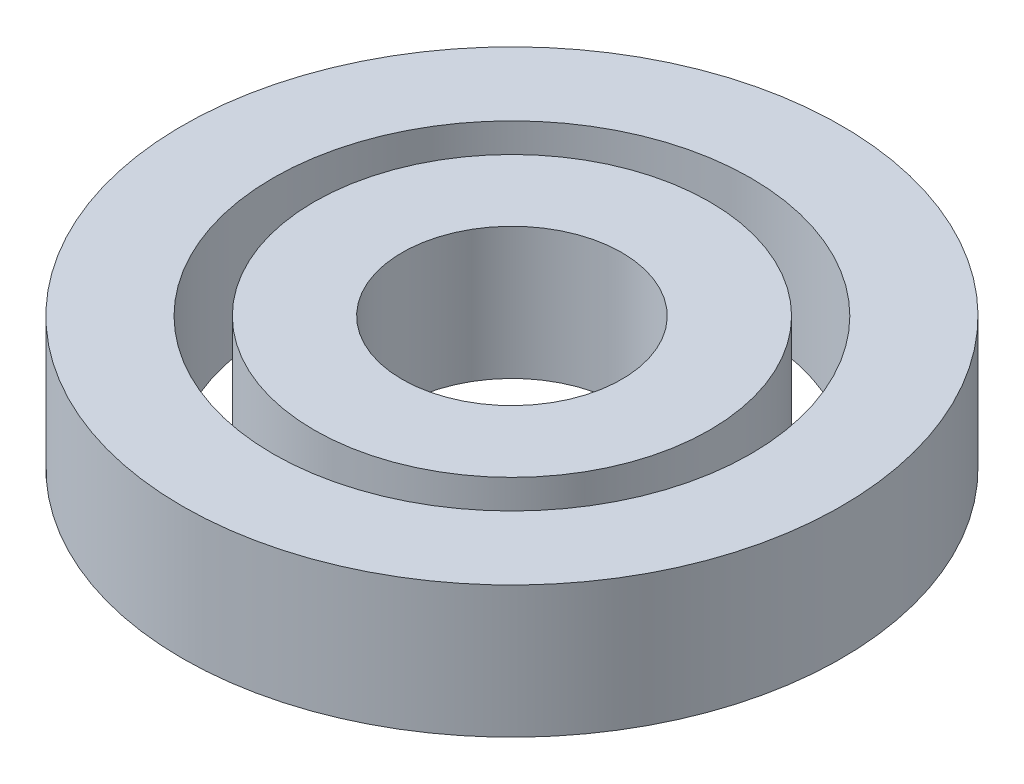
ISO-10303-21;
HEADER;
FILE_DESCRIPTION(('STEP AP214'),'2;1');
FILE_NAME('part.step','',(''),(''),'','','');
FILE_SCHEMA(('AUTOMOTIVE_DESIGN { 1 0 10303 214 1 1 1 1 }'));
ENDSEC;
DATA;
#1=APPLICATION_CONTEXT('core data for automotive mechanical design processes');
#2=APPLICATION_PROTOCOL_DEFINITION('international standard','automotive_design',2000,#1);
#3=PRODUCT_CONTEXT('',#1,'mechanical');
#4=PRODUCT('Part','Part','',(#3));
#5=PRODUCT_RELATED_PRODUCT_CATEGORY('part','',(#4));
#6=PRODUCT_DEFINITION_FORMATION('','',#4);
#7=PRODUCT_DEFINITION_CONTEXT('part definition',#1,'design');
#8=PRODUCT_DEFINITION('design','',#6,#7);
#9=PRODUCT_DEFINITION_SHAPE('','',#8);
#10=(LENGTH_UNIT() NAMED_UNIT(*) SI_UNIT(.MILLI.,.METRE.));
#11=(NAMED_UNIT(*) PLANE_ANGLE_UNIT() SI_UNIT($,.RADIAN.));
#12=(NAMED_UNIT(*) SI_UNIT($,.STERADIAN.) SOLID_ANGLE_UNIT());
#13=UNCERTAINTY_MEASURE_WITH_UNIT(LENGTH_MEASURE(1.E-05),#10,'distance_accuracy_value','');
#14=(GEOMETRIC_REPRESENTATION_CONTEXT(3) GLOBAL_UNCERTAINTY_ASSIGNED_CONTEXT((#13)) GLOBAL_UNIT_ASSIGNED_CONTEXT((#10,
#11,#12)) REPRESENTATION_CONTEXT('',''));
#15=CARTESIAN_POINT('',(0.,0.,0.));
#16=DIRECTION('',(0.,0.,1.));
#17=DIRECTION('',(1.,0.,0.));
#18=AXIS2_PLACEMENT_3D('',#15,#16,#17);
#19=CARTESIAN_POINT('',(0.,12.,0.));
#20=DIRECTION('',(0.,1.,0.));
#21=DIRECTION('',(0.,0.,1.));
#22=AXIS2_PLACEMENT_3D('',#19,#20,#21);
#23=PLANE('',#22);
#24=CARTESIAN_POINT('',(0.,12.,0.));
#25=DIRECTION('',(0.,1.,0.));
#26=DIRECTION('',(0.,0.,1.));
#27=AXIS2_PLACEMENT_3D('',#24,#25,#26);
#28=CIRCLE('',#27,30.);
#29=CARTESIAN_POINT('',(0.,12.,30.));
#30=VERTEX_POINT('',#29);
#31=EDGE_CURVE('E11',#30,#30,#28,.T.);
#32=ORIENTED_EDGE('',*,*,#31,.T.);
#33=EDGE_LOOP('',(#32));
#34=FACE_BOUND('',#33,.T.);
#35=CARTESIAN_POINT('',(0.,12.,0.));
#36=DIRECTION('',(0.,1.,0.));
#37=DIRECTION('',(0.,0.,1.));
#38=AXIS2_PLACEMENT_3D('',#35,#36,#37);
#39=CIRCLE('',#38,21.75);
#40=CARTESIAN_POINT('',(0.,12.,21.75));
#41=VERTEX_POINT('',#40);
#42=EDGE_CURVE('E58',#41,#41,#39,.T.);
#43=ORIENTED_EDGE('',*,*,#42,.F.);
#44=EDGE_LOOP('',(#43));
#45=FACE_BOUND('',#44,.T.);
#46=ADVANCED_FACE('F45',(#34,#45),#23,.T.);
#47=CARTESIAN_POINT('',(0.,0.,0.));
#48=DIRECTION('',(0.,1.,0.));
#49=DIRECTION('',(0.,0.,1.));
#50=AXIS2_PLACEMENT_3D('',#47,#48,#49);
#51=PLANE('',#50);
#52=CARTESIAN_POINT('',(0.,0.,0.));
#53=DIRECTION('',(0.,1.,0.));
#54=DIRECTION('',(0.,0.,1.));
#55=AXIS2_PLACEMENT_3D('',#52,#53,#54);
#56=CIRCLE('',#55,30.);
#57=CARTESIAN_POINT('',(0.,0.,30.));
#58=VERTEX_POINT('',#57);
#59=EDGE_CURVE('E49',#58,#58,#56,.T.);
#60=ORIENTED_EDGE('',*,*,#59,.F.);
#61=EDGE_LOOP('',(#60));
#62=FACE_BOUND('',#61,.T.);
#63=CARTESIAN_POINT('',(0.,0.,0.));
#64=DIRECTION('',(0.,1.,0.));
#65=DIRECTION('',(0.,0.,1.));
#66=AXIS2_PLACEMENT_3D('',#63,#64,#65);
#67=CIRCLE('',#66,21.75);
#68=CARTESIAN_POINT('',(0.,0.,21.75));
#69=VERTEX_POINT('',#68);
#70=EDGE_CURVE('E60',#69,#69,#67,.T.);
#71=ORIENTED_EDGE('',*,*,#70,.T.);
#72=EDGE_LOOP('',(#71));
#73=FACE_BOUND('',#72,.T.);
#74=ADVANCED_FACE('F72',(#62,#73),#51,.F.);
#75=CARTESIAN_POINT('',(0.,12.,0.));
#76=DIRECTION('',(0.,-1.,0.));
#77=DIRECTION('',(0.,0.,-1.));
#78=AXIS2_PLACEMENT_3D('',#75,#76,#77);
#79=CYLINDRICAL_SURFACE('',#78,30.);
#80=ORIENTED_EDGE('',*,*,#31,.F.);
#81=EDGE_LOOP('',(#80));
#82=FACE_BOUND('',#81,.T.);
#83=ORIENTED_EDGE('',*,*,#59,.T.);
#84=EDGE_LOOP('',(#83));
#85=FACE_BOUND('',#84,.T.);
#86=ADVANCED_FACE('F47',(#82,#85),#79,.T.);
#87=CARTESIAN_POINT('',(0.,12.,0.));
#88=DIRECTION('',(0.,-1.,0.));
#89=DIRECTION('',(0.,0.,-1.));
#90=AXIS2_PLACEMENT_3D('',#87,#88,#89);
#91=CYLINDRICAL_SURFACE('',#90,21.75);
#92=ORIENTED_EDGE('',*,*,#42,.T.);
#93=EDGE_LOOP('',(#92));
#94=FACE_BOUND('',#93,.T.);
#95=ORIENTED_EDGE('',*,*,#70,.F.);
#96=EDGE_LOOP('',(#95));
#97=FACE_BOUND('',#96,.T.);
#98=ADVANCED_FACE('F68',(#94,#97),#91,.F.);
#99=CLOSED_SHELL('',(#46,#74,#86,#98));
#100=MANIFOLD_SOLID_BREP('B2',#99);
#101=CARTESIAN_POINT('',(0.,12.,0.));
#102=DIRECTION('',(0.,1.,0.));
#103=DIRECTION('',(0.,0.,1.));
#104=AXIS2_PLACEMENT_3D('',#101,#102,#103);
#105=PLANE('',#104);
#106=CARTESIAN_POINT('',(0.,12.,0.));
#107=DIRECTION('',(0.,1.,0.));
#108=DIRECTION('',(0.,0.,1.));
#109=AXIS2_PLACEMENT_3D('',#106,#107,#108);
#110=CIRCLE('',#109,18.);
#111=CARTESIAN_POINT('',(0.,12.,18.));
#112=VERTEX_POINT('',#111);
#113=EDGE_CURVE('E44',#112,#112,#110,.T.);
#114=ORIENTED_EDGE('',*,*,#113,.T.);
#115=EDGE_LOOP('',(#114));
#116=FACE_BOUND('',#115,.T.);
#117=CARTESIAN_POINT('',(0.,12.,0.));
#118=DIRECTION('',(0.,1.,0.));
#119=DIRECTION('',(0.,0.,1.));
#120=AXIS2_PLACEMENT_3D('',#117,#118,#119);
#121=CIRCLE('',#120,10.);
#122=CARTESIAN_POINT('',(0.,12.,10.));
#123=VERTEX_POINT('',#122);
#124=EDGE_CURVE('E122',#123,#123,#121,.T.);
#125=ORIENTED_EDGE('',*,*,#124,.F.);
#126=EDGE_LOOP('',(#125));
#127=FACE_BOUND('',#126,.T.);
#128=ADVANCED_FACE('F111',(#116,#127),#105,.T.);
#129=CARTESIAN_POINT('',(0.,0.,0.));
#130=DIRECTION('',(0.,1.,0.));
#131=DIRECTION('',(0.,0.,1.));
#132=AXIS2_PLACEMENT_3D('',#129,#130,#131);
#133=PLANE('',#132);
#134=CARTESIAN_POINT('',(0.,0.,0.));
#135=DIRECTION('',(0.,1.,0.));
#136=DIRECTION('',(0.,0.,1.));
#137=AXIS2_PLACEMENT_3D('',#134,#135,#136);
#138=CIRCLE('',#137,18.);
#139=CARTESIAN_POINT('',(0.,0.,18.));
#140=VERTEX_POINT('',#139);
#141=EDGE_CURVE('E115',#140,#140,#138,.T.);
#142=ORIENTED_EDGE('',*,*,#141,.F.);
#143=EDGE_LOOP('',(#142));
#144=FACE_BOUND('',#143,.T.);
#145=CARTESIAN_POINT('',(0.,0.,0.));
#146=DIRECTION('',(0.,1.,0.));
#147=DIRECTION('',(0.,0.,1.));
#148=AXIS2_PLACEMENT_3D('',#145,#146,#147);
#149=CIRCLE('',#148,10.);
#150=CARTESIAN_POINT('',(0.,0.,10.));
#151=VERTEX_POINT('',#150);
#152=EDGE_CURVE('E124',#151,#151,#149,.T.);
#153=ORIENTED_EDGE('',*,*,#152,.T.);
#154=EDGE_LOOP('',(#153));
#155=FACE_BOUND('',#154,.T.);
#156=ADVANCED_FACE('F134',(#144,#155),#133,.F.);
#157=CARTESIAN_POINT('',(0.,12.,0.));
#158=DIRECTION('',(0.,-1.,0.));
#159=DIRECTION('',(0.,0.,-1.));
#160=AXIS2_PLACEMENT_3D('',#157,#158,#159);
#161=CYLINDRICAL_SURFACE('',#160,18.);
#162=ORIENTED_EDGE('',*,*,#113,.F.);
#163=EDGE_LOOP('',(#162));
#164=FACE_BOUND('',#163,.T.);
#165=ORIENTED_EDGE('',*,*,#141,.T.);
#166=EDGE_LOOP('',(#165));
#167=FACE_BOUND('',#166,.T.);
#168=ADVANCED_FACE('F113',(#164,#167),#161,.T.);
#169=CARTESIAN_POINT('',(0.,12.,0.));
#170=DIRECTION('',(0.,-1.,0.));
#171=DIRECTION('',(0.,0.,-1.));
#172=AXIS2_PLACEMENT_3D('',#169,#170,#171);
#173=CYLINDRICAL_SURFACE('',#172,10.);
#174=ORIENTED_EDGE('',*,*,#124,.T.);
#175=EDGE_LOOP('',(#174));
#176=FACE_BOUND('',#175,.T.);
#177=ORIENTED_EDGE('',*,*,#152,.F.);
#178=EDGE_LOOP('',(#177));
#179=FACE_BOUND('',#178,.T.);
#180=ADVANCED_FACE('F130',(#176,#179),#173,.F.);
#181=CLOSED_SHELL('',(#128,#156,#168,#180));
#182=MANIFOLD_SOLID_BREP('B6',#181);
#183=ADVANCED_BREP_SHAPE_REPRESENTATION('',(#18,#100,#182),#14);
#184=SHAPE_DEFINITION_REPRESENTATION(#9,#183);
ENDSEC;
END-ISO-10303-21;
